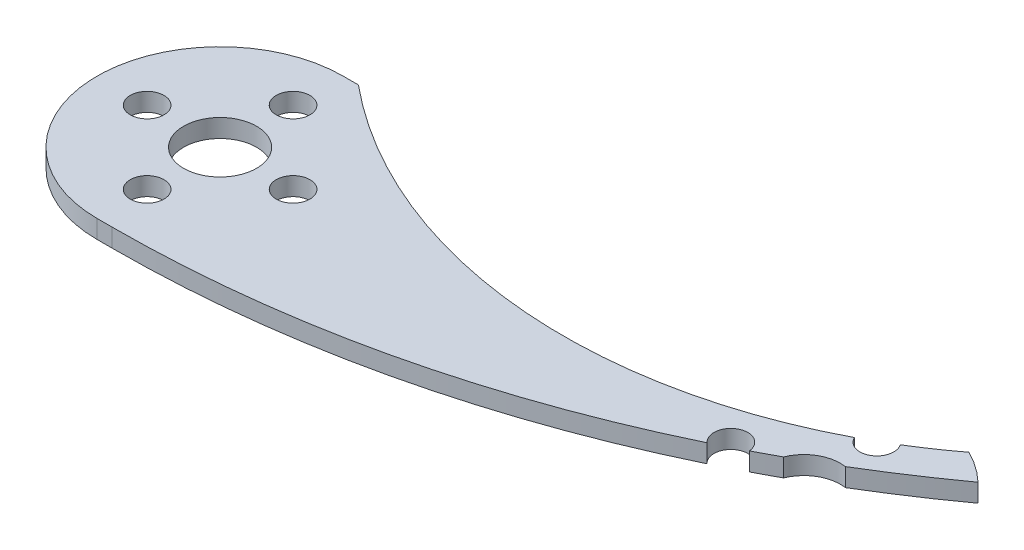
ISO-10303-21;
HEADER;
FILE_DESCRIPTION(('STEP AP214'),'2;1');
FILE_NAME('part.step','',(''),(''),'','','');
FILE_SCHEMA(('AUTOMOTIVE_DESIGN { 1 0 10303 214 1 1 1 1 }'));
ENDSEC;
DATA;
#1=APPLICATION_CONTEXT('core data for automotive mechanical design processes');
#2=APPLICATION_PROTOCOL_DEFINITION('international standard','automotive_design',2000,#1);
#3=PRODUCT_CONTEXT('',#1,'mechanical');
#4=PRODUCT('Part','Part','',(#3));
#5=PRODUCT_RELATED_PRODUCT_CATEGORY('part','',(#4));
#6=PRODUCT_DEFINITION_FORMATION('','',#4);
#7=PRODUCT_DEFINITION_CONTEXT('part definition',#1,'design');
#8=PRODUCT_DEFINITION('design','',#6,#7);
#9=PRODUCT_DEFINITION_SHAPE('','',#8);
#10=(LENGTH_UNIT() NAMED_UNIT(*) SI_UNIT(.MILLI.,.METRE.));
#11=(NAMED_UNIT(*) PLANE_ANGLE_UNIT() SI_UNIT($,.RADIAN.));
#12=(NAMED_UNIT(*) SI_UNIT($,.STERADIAN.) SOLID_ANGLE_UNIT());
#13=UNCERTAINTY_MEASURE_WITH_UNIT(LENGTH_MEASURE(1.E-05),#10,'distance_accuracy_value','');
#14=(GEOMETRIC_REPRESENTATION_CONTEXT(3) GLOBAL_UNCERTAINTY_ASSIGNED_CONTEXT((#13)) GLOBAL_UNIT_ASSIGNED_CONTEXT((#10,
#11,#12)) REPRESENTATION_CONTEXT('',''));
#15=CARTESIAN_POINT('',(0.,0.,0.));
#16=DIRECTION('',(0.,0.,1.));
#17=DIRECTION('',(1.,0.,0.));
#18=AXIS2_PLACEMENT_3D('',#15,#16,#17);
#19=CARTESIAN_POINT('',(39.2725364716305,2.,-9.4769351192583));
#20=DIRECTION('',(0.,1.,0.));
#21=DIRECTION('',(0.,0.,1.));
#22=AXIS2_PLACEMENT_3D('',#19,#20,#21);
#23=PLANE('',#22);
#24=CARTESIAN_POINT('',(-23.0674854419521,2.,-118.133968078478));
#25=DIRECTION('',(0.,-1.,0.));
#26=DIRECTION('',(0.,0.,1.));
#27=AXIS2_PLACEMENT_3D('',#24,#25,#26);
#28=CIRCLE('',#27,122.15703295922);
#29=CARTESIAN_POINT('',(48.616218240301,2.,-19.2209389680781));
#30=VERTEX_POINT('',#29);
#31=CARTESIAN_POINT('',(39.8618916577352,2.,-13.4332794501541));
#32=VERTEX_POINT('',#31);
#33=EDGE_CURVE('E48',#30,#32,#28,.T.);
#34=ORIENTED_EDGE('',*,*,#33,.F.);
#35=CARTESIAN_POINT('',(39.2725364716305,2.,-9.4769351192583));
#36=DIRECTION('',(0.,1.,0.));
#37=DIRECTION('',(0.,0.,1.));
#38=AXIS2_PLACEMENT_3D('',#35,#36,#37);
#39=CIRCLE('',#38,13.5);
#40=CARTESIAN_POINT('',(45.2780619151451,2.,-21.5675787806726));
#41=VERTEX_POINT('',#40);
#42=EDGE_CURVE('E147',#30,#41,#39,.T.);
#43=ORIENTED_EDGE('',*,*,#42,.T.);
#44=CARTESIAN_POINT('',(11.995865919736,2.,-65.4600708134649));
#45=DIRECTION('',(0.,1.,0.));
#46=DIRECTION('',(0.,0.,1.));
#47=AXIS2_PLACEMENT_3D('',#44,#45,#46);
#48=CIRCLE('',#47,55.0840759850392);
#49=CARTESIAN_POINT('',(40.8064749331316,2.,-18.511117306461));
#50=VERTEX_POINT('',#49);
#51=EDGE_CURVE('E246',#50,#41,#48,.T.);
#52=ORIENTED_EDGE('',*,*,#51,.F.);
#53=CARTESIAN_POINT('',(39.2725364716305,2.,-17.4769351192583));
#54=DIRECTION('',(0.,1.,0.));
#55=DIRECTION('',(0.,0.,1.));
#56=AXIS2_PLACEMENT_3D('',#53,#54,#55);
#57=CIRCLE('',#56,1.85);
#58=CARTESIAN_POINT('',(37.5992317174801,2.,-16.687915981507));
#59=VERTEX_POINT('',#58);
#60=EDGE_CURVE('E189',#59,#50,#57,.T.);
#61=ORIENTED_EDGE('',*,*,#60,.F.);
#62=CARTESIAN_POINT('',(-23.0674854419521,2.,-22.9769351192583));
#63=VERTEX_POINT('',#62);
#64=EDGE_CURVE('E241',#63,#59,#48,.T.);
#65=ORIENTED_EDGE('',*,*,#64,.F.);
#66=DIRECTION('',(-1.,0.,0.));
#67=VECTOR('',#66,1.);
#68=CARTESIAN_POINT('',(39.2725364716305,2.,-22.9769351192583));
#69=LINE('',#68,#67);
#70=CARTESIAN_POINT('',(-24.7274635283695,2.,-22.9769351192583));
#71=VERTEX_POINT('',#70);
#72=EDGE_CURVE('E150',#63,#71,#69,.T.);
#73=ORIENTED_EDGE('',*,*,#72,.T.);
#74=CARTESIAN_POINT('',(-24.7274635283695,2.,-9.4769351192583));
#75=DIRECTION('',(0.,1.,0.));
#76=DIRECTION('',(0.,0.,1.));
#77=AXIS2_PLACEMENT_3D('',#74,#75,#76);
#78=CIRCLE('',#77,13.5);
#79=CARTESIAN_POINT('',(-24.7274635283695,2.,4.02306488074169));
#80=VERTEX_POINT('',#79);
#81=EDGE_CURVE('E226',#71,#80,#78,.T.);
#82=ORIENTED_EDGE('',*,*,#81,.T.);
#83=DIRECTION('',(1.,0.,0.));
#84=VECTOR('',#83,1.);
#85=CARTESIAN_POINT('',(-24.7274635283695,2.,4.0230648807417));
#86=LINE('',#85,#84);
#87=CARTESIAN_POINT('',(-23.0674854419521,2.,4.02306488074169));
#88=VERTEX_POINT('',#87);
#89=EDGE_CURVE('E158',#80,#88,#86,.T.);
#90=ORIENTED_EDGE('',*,*,#89,.T.);
#91=CARTESIAN_POINT('',(30.0199494816509,2.,-8.11549256353504));
#92=VERTEX_POINT('',#91);
#93=EDGE_CURVE('E122',#92,#88,#28,.T.);
#94=ORIENTED_EDGE('',*,*,#93,.F.);
#95=CARTESIAN_POINT('',(31.2725364716305,2.,-9.4769351192583));
#96=DIRECTION('',(0.,1.,0.));
#97=DIRECTION('',(0.,0.,1.));
#98=AXIS2_PLACEMENT_3D('',#95,#96,#97);
#99=CIRCLE('',#98,1.85);
#100=CARTESIAN_POINT('',(33.1132113078056,2.,-9.66245101472691));
#101=VERTEX_POINT('',#100);
#102=EDGE_CURVE('E170',#101,#92,#99,.T.);
#103=ORIENTED_EDGE('',*,*,#102,.F.);
#104=CARTESIAN_POINT('',(35.5595977053779,2.,-10.9649155351437));
#105=VERTEX_POINT('',#104);
#106=EDGE_CURVE('E171',#105,#101,#28,.T.);
#107=ORIENTED_EDGE('',*,*,#106,.F.);
#108=CARTESIAN_POINT('',(39.2725364716305,2.,-9.4769351192583));
#109=DIRECTION('',(0.,1.,0.));
#110=DIRECTION('',(0.,0.,1.));
#111=AXIS2_PLACEMENT_3D('',#108,#109,#110);
#112=CIRCLE('',#111,4.00000000000001);
#113=EDGE_CURVE('E178',#32,#105,#112,.T.);
#114=ORIENTED_EDGE('',*,*,#113,.F.);
#115=EDGE_LOOP('',(#34,#43,#52,#61,#65,#73,#82,#90,#94,#103,#107,#114));
#116=FACE_BOUND('',#115,.T.);
#117=CARTESIAN_POINT('',(-16.7274635283695,2.,-9.4769351192583));
#118=DIRECTION('',(0.,1.,0.));
#119=DIRECTION('',(0.,0.,1.));
#120=AXIS2_PLACEMENT_3D('',#117,#118,#119);
#121=CIRCLE('',#120,1.85);
#122=CARTESIAN_POINT('',(-16.7274635283695,2.,-7.6269351192583));
#123=VERTEX_POINT('',#122);
#124=EDGE_CURVE('E195',#123,#123,#121,.T.);
#125=ORIENTED_EDGE('',*,*,#124,.F.);
#126=EDGE_LOOP('',(#125));
#127=FACE_BOUND('',#126,.T.);
#128=CARTESIAN_POINT('',(-32.7274635283695,2.,-9.4769351192583));
#129=DIRECTION('',(0.,1.,0.));
#130=DIRECTION('',(0.,0.,1.));
#131=AXIS2_PLACEMENT_3D('',#128,#129,#130);
#132=CIRCLE('',#131,1.85);
#133=CARTESIAN_POINT('',(-32.7274635283695,2.,-7.62693511925831));
#134=VERTEX_POINT('',#133);
#135=EDGE_CURVE('E207',#134,#134,#132,.T.);
#136=ORIENTED_EDGE('',*,*,#135,.F.);
#137=EDGE_LOOP('',(#136));
#138=FACE_BOUND('',#137,.T.);
#139=CARTESIAN_POINT('',(-24.7274635283695,2.,-17.4769351192583));
#140=DIRECTION('',(0.,1.,0.));
#141=DIRECTION('',(0.,0.,1.));
#142=AXIS2_PLACEMENT_3D('',#139,#140,#141);
#143=CIRCLE('',#142,1.85);
#144=CARTESIAN_POINT('',(-24.7274635283695,2.,-15.6269351192583));
#145=VERTEX_POINT('',#144);
#146=EDGE_CURVE('E219',#145,#145,#143,.T.);
#147=ORIENTED_EDGE('',*,*,#146,.F.);
#148=EDGE_LOOP('',(#147));
#149=FACE_BOUND('',#148,.T.);
#150=CARTESIAN_POINT('',(-24.7274635283695,2.,-9.4769351192583));
#151=DIRECTION('',(0.,1.,0.));
#152=DIRECTION('',(0.,0.,1.));
#153=AXIS2_PLACEMENT_3D('',#150,#151,#152);
#154=CIRCLE('',#153,4.);
#155=CARTESIAN_POINT('',(-24.7274635283695,2.,-5.4769351192583));
#156=VERTEX_POINT('',#155);
#157=EDGE_CURVE('E213',#156,#156,#154,.T.);
#158=ORIENTED_EDGE('',*,*,#157,.F.);
#159=EDGE_LOOP('',(#158));
#160=FACE_BOUND('',#159,.T.);
#161=CARTESIAN_POINT('',(-24.7274635283695,2.,-1.4769351192583));
#162=DIRECTION('',(0.,1.,0.));
#163=DIRECTION('',(0.,0.,1.));
#164=AXIS2_PLACEMENT_3D('',#161,#162,#163);
#165=CIRCLE('',#164,1.85);
#166=CARTESIAN_POINT('',(-24.7274635283695,2.,0.373064880741695));
#167=VERTEX_POINT('',#166);
#168=EDGE_CURVE('E201',#167,#167,#165,.T.);
#169=ORIENTED_EDGE('',*,*,#168,.F.);
#170=EDGE_LOOP('',(#169));
#171=FACE_BOUND('',#170,.T.);
#172=ADVANCED_FACE('F33',(#116,#127,#138,#149,#160,#171),#23,.T.);
#173=CARTESIAN_POINT('',(39.2725364716305,0.,-9.4769351192583));
#174=DIRECTION('',(0.,1.,0.));
#175=DIRECTION('',(0.,0.,1.));
#176=AXIS2_PLACEMENT_3D('',#173,#174,#175);
#177=PLANE('',#176);
#178=CARTESIAN_POINT('',(39.2725364716305,0.,-9.4769351192583));
#179=DIRECTION('',(0.,1.,0.));
#180=DIRECTION('',(0.,0.,1.));
#181=AXIS2_PLACEMENT_3D('',#178,#179,#180);
#182=CIRCLE('',#181,13.5);
#183=CARTESIAN_POINT('',(48.616218240301,0.,-19.2209389680781));
#184=VERTEX_POINT('',#183);
#185=CARTESIAN_POINT('',(45.2780619151451,0.,-21.5675787806726));
#186=VERTEX_POINT('',#185);
#187=EDGE_CURVE('E222',#184,#186,#182,.T.);
#188=ORIENTED_EDGE('',*,*,#187,.F.);
#189=CARTESIAN_POINT('',(-23.0674854419521,0.,-118.133968078478));
#190=DIRECTION('',(0.,-1.,0.));
#191=DIRECTION('',(0.,0.,1.));
#192=AXIS2_PLACEMENT_3D('',#189,#190,#191);
#193=CIRCLE('',#192,122.15703295922);
#194=CARTESIAN_POINT('',(39.8618916577351,0.,-13.433279450154));
#195=VERTEX_POINT('',#194);
#196=EDGE_CURVE('E128',#184,#195,#193,.T.);
#197=ORIENTED_EDGE('',*,*,#196,.T.);
#198=CARTESIAN_POINT('',(39.2725364716305,0.,-9.4769351192583));
#199=DIRECTION('',(0.,1.,0.));
#200=DIRECTION('',(0.,0.,1.));
#201=AXIS2_PLACEMENT_3D('',#198,#199,#200);
#202=CIRCLE('',#201,4.00000000000001);
#203=CARTESIAN_POINT('',(35.5595977053779,0.,-10.9649155351437));
#204=VERTEX_POINT('',#203);
#205=EDGE_CURVE('E175',#195,#204,#202,.T.);
#206=ORIENTED_EDGE('',*,*,#205,.T.);
#207=CARTESIAN_POINT('',(33.1132113078057,0.,-9.66245101472692));
#208=VERTEX_POINT('',#207);
#209=EDGE_CURVE('E141',#204,#208,#193,.T.);
#210=ORIENTED_EDGE('',*,*,#209,.T.);
#211=CARTESIAN_POINT('',(31.2725364716305,0.,-9.4769351192583));
#212=DIRECTION('',(0.,1.,0.));
#213=DIRECTION('',(0.,0.,1.));
#214=AXIS2_PLACEMENT_3D('',#211,#212,#213);
#215=CIRCLE('',#214,1.85);
#216=CARTESIAN_POINT('',(30.019949481651,0.,-8.1154925635351));
#217=VERTEX_POINT('',#216);
#218=EDGE_CURVE('E140',#208,#217,#215,.T.);
#219=ORIENTED_EDGE('',*,*,#218,.T.);
#220=CARTESIAN_POINT('',(-23.0674854419521,0.,4.02306488074169));
#221=VERTEX_POINT('',#220);
#222=EDGE_CURVE('E56',#217,#221,#193,.T.);
#223=ORIENTED_EDGE('',*,*,#222,.T.);
#224=DIRECTION('',(1.,0.,0.));
#225=VECTOR('',#224,1.);
#226=CARTESIAN_POINT('',(-24.7274635283695,0.,4.0230648807417));
#227=LINE('',#226,#225);
#228=CARTESIAN_POINT('',(-24.7274635283695,0.,4.02306488074169));
#229=VERTEX_POINT('',#228);
#230=EDGE_CURVE('E137',#229,#221,#227,.T.);
#231=ORIENTED_EDGE('',*,*,#230,.F.);
#232=CARTESIAN_POINT('',(-24.7274635283695,0.,-9.4769351192583));
#233=DIRECTION('',(0.,1.,0.));
#234=DIRECTION('',(0.,0.,1.));
#235=AXIS2_PLACEMENT_3D('',#232,#233,#234);
#236=CIRCLE('',#235,13.5);
#237=CARTESIAN_POINT('',(-24.7274635283695,0.,-22.9769351192583));
#238=VERTEX_POINT('',#237);
#239=EDGE_CURVE('E148',#238,#229,#236,.T.);
#240=ORIENTED_EDGE('',*,*,#239,.F.);
#241=DIRECTION('',(-1.,0.,0.));
#242=VECTOR('',#241,1.);
#243=CARTESIAN_POINT('',(39.2725364716305,0.,-22.9769351192583));
#244=LINE('',#243,#242);
#245=CARTESIAN_POINT('',(-23.0674854419521,0.,-22.9769351192583));
#246=VERTEX_POINT('',#245);
#247=EDGE_CURVE('E152',#246,#238,#244,.T.);
#248=ORIENTED_EDGE('',*,*,#247,.F.);
#249=CARTESIAN_POINT('',(11.995865919736,0.,-65.4600708134649));
#250=DIRECTION('',(0.,1.,0.));
#251=DIRECTION('',(0.,0.,1.));
#252=AXIS2_PLACEMENT_3D('',#249,#250,#251);
#253=CIRCLE('',#252,55.0840759850392);
#254=CARTESIAN_POINT('',(37.5992317174801,0.,-16.6879159815071));
#255=VERTEX_POINT('',#254);
#256=EDGE_CURVE('E249',#246,#255,#253,.T.);
#257=ORIENTED_EDGE('',*,*,#256,.T.);
#258=CARTESIAN_POINT('',(39.2725364716305,0.,-17.4769351192583));
#259=DIRECTION('',(0.,1.,0.));
#260=DIRECTION('',(0.,0.,1.));
#261=AXIS2_PLACEMENT_3D('',#258,#259,#260);
#262=CIRCLE('',#261,1.85);
#263=CARTESIAN_POINT('',(40.8064749331316,0.,-18.5111173064611));
#264=VERTEX_POINT('',#263);
#265=EDGE_CURVE('E187',#255,#264,#262,.T.);
#266=ORIENTED_EDGE('',*,*,#265,.T.);
#267=EDGE_CURVE('E245',#264,#186,#253,.T.);
#268=ORIENTED_EDGE('',*,*,#267,.T.);
#269=EDGE_LOOP('',(#188,#197,#206,#210,#219,#223,#231,#240,#248,#257,#266,#268));
#270=FACE_BOUND('',#269,.T.);
#271=CARTESIAN_POINT('',(-16.7274635283695,0.,-9.4769351192583));
#272=DIRECTION('',(0.,1.,0.));
#273=DIRECTION('',(0.,0.,1.));
#274=AXIS2_PLACEMENT_3D('',#271,#272,#273);
#275=CIRCLE('',#274,1.85);
#276=CARTESIAN_POINT('',(-16.7274635283695,0.,-7.6269351192583));
#277=VERTEX_POINT('',#276);
#278=EDGE_CURVE('E192',#277,#277,#275,.T.);
#279=ORIENTED_EDGE('',*,*,#278,.T.);
#280=EDGE_LOOP('',(#279));
#281=FACE_BOUND('',#280,.T.);
#282=CARTESIAN_POINT('',(-32.7274635283695,0.,-9.4769351192583));
#283=DIRECTION('',(0.,1.,0.));
#284=DIRECTION('',(0.,0.,1.));
#285=AXIS2_PLACEMENT_3D('',#282,#283,#284);
#286=CIRCLE('',#285,1.85);
#287=CARTESIAN_POINT('',(-32.7274635283695,0.,-7.62693511925831));
#288=VERTEX_POINT('',#287);
#289=EDGE_CURVE('E204',#288,#288,#286,.T.);
#290=ORIENTED_EDGE('',*,*,#289,.T.);
#291=EDGE_LOOP('',(#290));
#292=FACE_BOUND('',#291,.T.);
#293=CARTESIAN_POINT('',(-24.7274635283695,0.,-17.4769351192583));
#294=DIRECTION('',(0.,1.,0.));
#295=DIRECTION('',(0.,0.,1.));
#296=AXIS2_PLACEMENT_3D('',#293,#294,#295);
#297=CIRCLE('',#296,1.85);
#298=CARTESIAN_POINT('',(-24.7274635283695,0.,-15.6269351192583));
#299=VERTEX_POINT('',#298);
#300=EDGE_CURVE('E216',#299,#299,#297,.T.);
#301=ORIENTED_EDGE('',*,*,#300,.T.);
#302=EDGE_LOOP('',(#301));
#303=FACE_BOUND('',#302,.T.);
#304=CARTESIAN_POINT('',(-24.7274635283695,0.,-9.4769351192583));
#305=DIRECTION('',(0.,1.,0.));
#306=DIRECTION('',(0.,0.,1.));
#307=AXIS2_PLACEMENT_3D('',#304,#305,#306);
#308=CIRCLE('',#307,4.);
#309=CARTESIAN_POINT('',(-24.7274635283695,0.,-5.4769351192583));
#310=VERTEX_POINT('',#309);
#311=EDGE_CURVE('E210',#310,#310,#308,.T.);
#312=ORIENTED_EDGE('',*,*,#311,.T.);
#313=EDGE_LOOP('',(#312));
#314=FACE_BOUND('',#313,.T.);
#315=CARTESIAN_POINT('',(-24.7274635283695,0.,-1.4769351192583));
#316=DIRECTION('',(0.,1.,0.));
#317=DIRECTION('',(0.,0.,1.));
#318=AXIS2_PLACEMENT_3D('',#315,#316,#317);
#319=CIRCLE('',#318,1.85);
#320=CARTESIAN_POINT('',(-24.7274635283695,0.,0.373064880741695));
#321=VERTEX_POINT('',#320);
#322=EDGE_CURVE('E198',#321,#321,#319,.T.);
#323=ORIENTED_EDGE('',*,*,#322,.T.);
#324=EDGE_LOOP('',(#323));
#325=FACE_BOUND('',#324,.T.);
#326=ADVANCED_FACE('F134',(#270,#281,#292,#303,#314,#325),#177,.F.);
#327=CARTESIAN_POINT('',(39.2725364716305,2.,-9.4769351192583));
#328=DIRECTION('',(0.,-1.,0.));
#329=DIRECTION('',(0.,0.,-1.));
#330=AXIS2_PLACEMENT_3D('',#327,#328,#329);
#331=CYLINDRICAL_SURFACE('',#330,13.5);
#332=ORIENTED_EDGE('',*,*,#42,.F.);
#333=DIRECTION('',(0.,1.,0.));
#334=VECTOR('',#333,1.);
#335=CARTESIAN_POINT('',(48.616218240301,0.,-19.2209389680781));
#336=LINE('',#335,#334);
#337=EDGE_CURVE('E127',#184,#30,#336,.T.);
#338=ORIENTED_EDGE('',*,*,#337,.F.);
#339=ORIENTED_EDGE('',*,*,#187,.T.);
#340=DIRECTION('',(0.,1.,0.));
#341=VECTOR('',#340,1.);
#342=CARTESIAN_POINT('',(45.2780619151451,0.,-21.5675787806726));
#343=LINE('',#342,#341);
#344=EDGE_CURVE('E183',#186,#41,#343,.T.);
#345=ORIENTED_EDGE('',*,*,#344,.T.);
#346=EDGE_LOOP('',(#332,#338,#339,#345));
#347=FACE_BOUND('',#346,.T.);
#348=ADVANCED_FACE('F35',(#347),#331,.T.);
#349=CARTESIAN_POINT('',(39.2725364716305,2.,-22.9769351192583));
#350=DIRECTION('',(0.,0.,1.));
#351=DIRECTION('',(1.,0.,0.));
#352=AXIS2_PLACEMENT_3D('',#349,#350,#351);
#353=PLANE('',#352);
#354=ORIENTED_EDGE('',*,*,#72,.F.);
#355=DIRECTION('',(0.,1.,0.));
#356=VECTOR('',#355,1.);
#357=CARTESIAN_POINT('',(-23.0674854419521,0.,-22.9769351192583));
#358=LINE('',#357,#356);
#359=EDGE_CURVE('E180',#246,#63,#358,.T.);
#360=ORIENTED_EDGE('',*,*,#359,.F.);
#361=ORIENTED_EDGE('',*,*,#247,.T.);
#362=DIRECTION('',(0.,-1.,0.));
#363=VECTOR('',#362,1.);
#364=CARTESIAN_POINT('',(-24.7274635283695,2.,-22.9769351192583));
#365=LINE('',#364,#363);
#366=EDGE_CURVE('E157',#71,#238,#365,.T.);
#367=ORIENTED_EDGE('',*,*,#366,.F.);
#368=EDGE_LOOP('',(#354,#360,#361,#367));
#369=FACE_BOUND('',#368,.T.);
#370=ADVANCED_FACE('F234',(#369),#353,.F.);
#371=CARTESIAN_POINT('',(-24.7274635283695,2.,-9.4769351192583));
#372=DIRECTION('',(0.,-1.,0.));
#373=DIRECTION('',(0.,0.,-1.));
#374=AXIS2_PLACEMENT_3D('',#371,#372,#373);
#375=CYLINDRICAL_SURFACE('',#374,13.5);
#376=ORIENTED_EDGE('',*,*,#239,.T.);
#377=DIRECTION('',(0.,-1.,0.));
#378=VECTOR('',#377,1.);
#379=CARTESIAN_POINT('',(-24.7274635283695,2.,4.02306488074169));
#380=LINE('',#379,#378);
#381=EDGE_CURVE('E146',#80,#229,#380,.T.);
#382=ORIENTED_EDGE('',*,*,#381,.F.);
#383=ORIENTED_EDGE('',*,*,#81,.F.);
#384=ORIENTED_EDGE('',*,*,#366,.T.);
#385=EDGE_LOOP('',(#376,#382,#383,#384));
#386=FACE_BOUND('',#385,.T.);
#387=ADVANCED_FACE('F238',(#386),#375,.T.);
#388=CARTESIAN_POINT('',(-24.7274635283695,2.,4.0230648807417));
#389=DIRECTION('',(0.,0.,-1.));
#390=DIRECTION('',(-1.,0.,0.));
#391=AXIS2_PLACEMENT_3D('',#388,#389,#390);
#392=PLANE('',#391);
#393=ORIENTED_EDGE('',*,*,#230,.T.);
#394=DIRECTION('',(0.,1.,0.));
#395=VECTOR('',#394,1.);
#396=CARTESIAN_POINT('',(-23.0674854419521,0.,4.02306488074169));
#397=LINE('',#396,#395);
#398=EDGE_CURVE('E119',#221,#88,#397,.T.);
#399=ORIENTED_EDGE('',*,*,#398,.T.);
#400=ORIENTED_EDGE('',*,*,#89,.F.);
#401=ORIENTED_EDGE('',*,*,#381,.T.);
#402=EDGE_LOOP('',(#393,#399,#400,#401));
#403=FACE_BOUND('',#402,.T.);
#404=ADVANCED_FACE('F144',(#403),#392,.F.);
#405=CARTESIAN_POINT('',(-24.7274635283695,2.,-17.4769351192583));
#406=DIRECTION('',(0.,-1.,0.));
#407=DIRECTION('',(0.,0.,-1.));
#408=AXIS2_PLACEMENT_3D('',#405,#406,#407);
#409=CYLINDRICAL_SURFACE('',#408,1.85);
#410=ORIENTED_EDGE('',*,*,#146,.T.);
#411=EDGE_LOOP('',(#410));
#412=FACE_BOUND('',#411,.T.);
#413=ORIENTED_EDGE('',*,*,#300,.F.);
#414=EDGE_LOOP('',(#413));
#415=FACE_BOUND('',#414,.T.);
#416=ADVANCED_FACE('F291',(#412,#415),#409,.F.);
#417=CARTESIAN_POINT('',(-24.7274635283695,2.,-9.4769351192583));
#418=DIRECTION('',(0.,-1.,0.));
#419=DIRECTION('',(0.,0.,-1.));
#420=AXIS2_PLACEMENT_3D('',#417,#418,#419);
#421=CYLINDRICAL_SURFACE('',#420,4.);
#422=ORIENTED_EDGE('',*,*,#157,.T.);
#423=EDGE_LOOP('',(#422));
#424=FACE_BOUND('',#423,.T.);
#425=ORIENTED_EDGE('',*,*,#311,.F.);
#426=EDGE_LOOP('',(#425));
#427=FACE_BOUND('',#426,.T.);
#428=ADVANCED_FACE('F343',(#424,#427),#421,.F.);
#429=CARTESIAN_POINT('',(-32.7274635283695,2.,-9.4769351192583));
#430=DIRECTION('',(0.,-1.,0.));
#431=DIRECTION('',(0.,0.,-1.));
#432=AXIS2_PLACEMENT_3D('',#429,#430,#431);
#433=CYLINDRICAL_SURFACE('',#432,1.85);
#434=ORIENTED_EDGE('',*,*,#135,.T.);
#435=EDGE_LOOP('',(#434));
#436=FACE_BOUND('',#435,.T.);
#437=ORIENTED_EDGE('',*,*,#289,.F.);
#438=EDGE_LOOP('',(#437));
#439=FACE_BOUND('',#438,.T.);
#440=ADVANCED_FACE('F333',(#436,#439),#433,.F.);
#441=CARTESIAN_POINT('',(-24.7274635283695,2.,-1.4769351192583));
#442=DIRECTION('',(0.,-1.,0.));
#443=DIRECTION('',(0.,0.,-1.));
#444=AXIS2_PLACEMENT_3D('',#441,#442,#443);
#445=CYLINDRICAL_SURFACE('',#444,1.85);
#446=ORIENTED_EDGE('',*,*,#168,.T.);
#447=EDGE_LOOP('',(#446));
#448=FACE_BOUND('',#447,.T.);
#449=ORIENTED_EDGE('',*,*,#322,.F.);
#450=EDGE_LOOP('',(#449));
#451=FACE_BOUND('',#450,.T.);
#452=ADVANCED_FACE('F321',(#448,#451),#445,.F.);
#453=CARTESIAN_POINT('',(-16.7274635283695,2.,-9.4769351192583));
#454=DIRECTION('',(0.,-1.,0.));
#455=DIRECTION('',(0.,0.,-1.));
#456=AXIS2_PLACEMENT_3D('',#453,#454,#455);
#457=CYLINDRICAL_SURFACE('',#456,1.85);
#458=ORIENTED_EDGE('',*,*,#124,.T.);
#459=EDGE_LOOP('',(#458));
#460=FACE_BOUND('',#459,.T.);
#461=ORIENTED_EDGE('',*,*,#278,.F.);
#462=EDGE_LOOP('',(#461));
#463=FACE_BOUND('',#462,.T.);
#464=ADVANCED_FACE('F316',(#460,#463),#457,.F.);
#465=CARTESIAN_POINT('',(39.2725364716305,2.,-17.4769351192583));
#466=DIRECTION('',(0.,-1.,0.));
#467=DIRECTION('',(0.,0.,-1.));
#468=AXIS2_PLACEMENT_3D('',#465,#466,#467);
#469=CYLINDRICAL_SURFACE('',#468,1.85);
#470=DIRECTION('',(0.,1.,0.));
#471=VECTOR('',#470,1.);
#472=CARTESIAN_POINT('',(40.8064749331316,1.,-18.511117306461));
#473=LINE('',#472,#471);
#474=EDGE_CURVE('E163',#264,#50,#473,.T.);
#475=ORIENTED_EDGE('',*,*,#474,.F.);
#476=ORIENTED_EDGE('',*,*,#265,.F.);
#477=DIRECTION('',(0.,1.,0.));
#478=VECTOR('',#477,1.);
#479=CARTESIAN_POINT('',(37.5992317174801,1.,-16.687915981507));
#480=LINE('',#479,#478);
#481=EDGE_CURVE('E161',#59,#255,#480,.F.);
#482=ORIENTED_EDGE('',*,*,#481,.F.);
#483=ORIENTED_EDGE('',*,*,#60,.T.);
#484=EDGE_LOOP('',(#475,#476,#482,#483));
#485=FACE_BOUND('',#484,.T.);
#486=ADVANCED_FACE('F261',(#485),#469,.F.);
#487=CARTESIAN_POINT('',(39.2725364716305,2.,-9.4769351192583));
#488=DIRECTION('',(0.,-1.,0.));
#489=DIRECTION('',(0.,0.,-1.));
#490=AXIS2_PLACEMENT_3D('',#487,#488,#489);
#491=CYLINDRICAL_SURFACE('',#490,4.00000000000001);
#492=DIRECTION('',(0.,1.,0.));
#493=VECTOR('',#492,1.);
#494=CARTESIAN_POINT('',(39.8618916577353,1.,-13.4332794501541));
#495=LINE('',#494,#493);
#496=EDGE_CURVE('E252',#32,#195,#495,.F.);
#497=ORIENTED_EDGE('',*,*,#496,.F.);
#498=ORIENTED_EDGE('',*,*,#113,.T.);
#499=DIRECTION('',(0.,1.,0.));
#500=VECTOR('',#499,1.);
#501=CARTESIAN_POINT('',(35.5595977053778,1.,-10.9649155351437));
#502=LINE('',#501,#500);
#503=EDGE_CURVE('E266',#204,#105,#502,.T.);
#504=ORIENTED_EDGE('',*,*,#503,.F.);
#505=ORIENTED_EDGE('',*,*,#205,.F.);
#506=EDGE_LOOP('',(#497,#498,#504,#505));
#507=FACE_BOUND('',#506,.T.);
#508=ADVANCED_FACE('F272',(#507),#491,.F.);
#509=CARTESIAN_POINT('',(31.2725364716305,2.,-9.4769351192583));
#510=DIRECTION('',(0.,-1.,0.));
#511=DIRECTION('',(0.,0.,-1.));
#512=AXIS2_PLACEMENT_3D('',#509,#510,#511);
#513=CYLINDRICAL_SURFACE('',#512,1.85);
#514=DIRECTION('',(0.,1.,0.));
#515=VECTOR('',#514,1.);
#516=CARTESIAN_POINT('',(33.1132113078056,1.,-9.66245101472689));
#517=LINE('',#516,#515);
#518=EDGE_CURVE('E11',#101,#208,#517,.F.);
#519=ORIENTED_EDGE('',*,*,#518,.F.);
#520=ORIENTED_EDGE('',*,*,#102,.T.);
#521=DIRECTION('',(0.,1.,0.));
#522=VECTOR('',#521,1.);
#523=CARTESIAN_POINT('',(30.019949481651,1.,-8.11549256353508));
#524=LINE('',#523,#522);
#525=EDGE_CURVE('E41',#217,#92,#524,.T.);
#526=ORIENTED_EDGE('',*,*,#525,.F.);
#527=ORIENTED_EDGE('',*,*,#218,.F.);
#528=EDGE_LOOP('',(#519,#520,#526,#527));
#529=FACE_BOUND('',#528,.T.);
#530=ADVANCED_FACE('F174',(#529),#513,.F.);
#531=CARTESIAN_POINT('',(11.995865919736,0.,-65.4600708134649));
#532=DIRECTION('',(0.,1.,0.));
#533=DIRECTION('',(0.,0.,1.));
#534=AXIS2_PLACEMENT_3D('',#531,#532,#533);
#535=CYLINDRICAL_SURFACE('',#534,55.0840759850392);
#536=ORIENTED_EDGE('',*,*,#481,.T.);
#537=ORIENTED_EDGE('',*,*,#256,.F.);
#538=ORIENTED_EDGE('',*,*,#359,.T.);
#539=ORIENTED_EDGE('',*,*,#64,.T.);
#540=EDGE_LOOP('',(#536,#537,#538,#539));
#541=FACE_BOUND('',#540,.T.);
#542=ADVANCED_FACE('F397',(#541),#535,.F.);
#543=ORIENTED_EDGE('',*,*,#474,.T.);
#544=ORIENTED_EDGE('',*,*,#51,.T.);
#545=ORIENTED_EDGE('',*,*,#344,.F.);
#546=ORIENTED_EDGE('',*,*,#267,.F.);
#547=EDGE_LOOP('',(#543,#544,#545,#546));
#548=FACE_BOUND('',#547,.T.);
#549=ADVANCED_FACE('F263',(#548),#535,.F.);
#550=CARTESIAN_POINT('',(-23.0674854419521,0.,-118.133968078478));
#551=DIRECTION('',(0.,1.,0.));
#552=DIRECTION('',(0.,0.,1.));
#553=AXIS2_PLACEMENT_3D('',#550,#551,#552);
#554=CYLINDRICAL_SURFACE('',#553,122.15703295922);
#555=ORIENTED_EDGE('',*,*,#525,.T.);
#556=ORIENTED_EDGE('',*,*,#93,.T.);
#557=ORIENTED_EDGE('',*,*,#398,.F.);
#558=ORIENTED_EDGE('',*,*,#222,.F.);
#559=EDGE_LOOP('',(#555,#556,#557,#558));
#560=FACE_BOUND('',#559,.T.);
#561=ADVANCED_FACE('F120',(#560),#554,.T.);
#562=ORIENTED_EDGE('',*,*,#503,.T.);
#563=ORIENTED_EDGE('',*,*,#106,.T.);
#564=ORIENTED_EDGE('',*,*,#518,.T.);
#565=ORIENTED_EDGE('',*,*,#209,.F.);
#566=EDGE_LOOP('',(#562,#563,#564,#565));
#567=FACE_BOUND('',#566,.T.);
#568=ADVANCED_FACE('F275',(#567),#554,.T.);
#569=ORIENTED_EDGE('',*,*,#496,.T.);
#570=ORIENTED_EDGE('',*,*,#196,.F.);
#571=ORIENTED_EDGE('',*,*,#337,.T.);
#572=ORIENTED_EDGE('',*,*,#33,.T.);
#573=EDGE_LOOP('',(#569,#570,#571,#572));
#574=FACE_BOUND('',#573,.T.);
#575=ADVANCED_FACE('F277',(#574),#554,.T.);
#576=CLOSED_SHELL('',(#172,#326,#348,#370,#387,#404,#416,#428,#440,#452,#464,#486,#508,#530,
#542,#549,#561,#568,#575));
#577=MANIFOLD_SOLID_BREP('B2',#576);
#578=ADVANCED_BREP_SHAPE_REPRESENTATION('',(#18,#577),#14);
#579=SHAPE_DEFINITION_REPRESENTATION(#9,#578);
ENDSEC;
END-ISO-10303-21;
